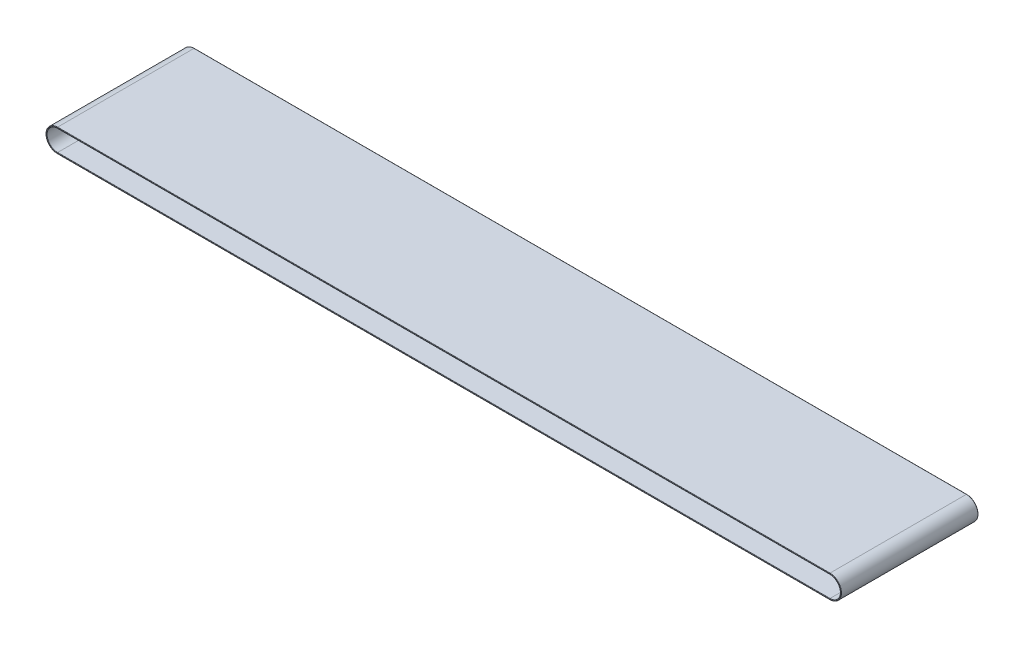
ISO-10303-21;
HEADER;
FILE_DESCRIPTION(('STEP AP214'),'2;1');
FILE_NAME('part.step','',(''),(''),'','','');
FILE_SCHEMA(('AUTOMOTIVE_DESIGN { 1 0 10303 214 1 1 1 1 }'));
ENDSEC;
DATA;
#1=APPLICATION_CONTEXT('core data for automotive mechanical design processes');
#2=APPLICATION_PROTOCOL_DEFINITION('international standard','automotive_design',2000,#1);
#3=PRODUCT_CONTEXT('',#1,'mechanical');
#4=PRODUCT('Part','Part','',(#3));
#5=PRODUCT_RELATED_PRODUCT_CATEGORY('part','',(#4));
#6=PRODUCT_DEFINITION_FORMATION('','',#4);
#7=PRODUCT_DEFINITION_CONTEXT('part definition',#1,'design');
#8=PRODUCT_DEFINITION('design','',#6,#7);
#9=PRODUCT_DEFINITION_SHAPE('','',#8);
#10=(LENGTH_UNIT() NAMED_UNIT(*) SI_UNIT(.MILLI.,.METRE.));
#11=(NAMED_UNIT(*) PLANE_ANGLE_UNIT() SI_UNIT($,.RADIAN.));
#12=(NAMED_UNIT(*) SI_UNIT($,.STERADIAN.) SOLID_ANGLE_UNIT());
#13=UNCERTAINTY_MEASURE_WITH_UNIT(LENGTH_MEASURE(1.E-05),#10,'distance_accuracy_value','');
#14=(GEOMETRIC_REPRESENTATION_CONTEXT(3) GLOBAL_UNCERTAINTY_ASSIGNED_CONTEXT((#13)) GLOBAL_UNIT_ASSIGNED_CONTEXT((#10,
#11,#12)) REPRESENTATION_CONTEXT('',''));
#15=CARTESIAN_POINT('',(0.,0.,0.));
#16=DIRECTION('',(0.,0.,1.));
#17=DIRECTION('',(1.,0.,0.));
#18=AXIS2_PLACEMENT_3D('',#15,#16,#17);
#19=CARTESIAN_POINT('',(0.,4.25449999999998,50.673));
#20=DIRECTION('',(0.,1.,0.));
#21=DIRECTION('',(0.,0.,1.));
#22=AXIS2_PLACEMENT_3D('',#19,#20,#21);
#23=PLANE('',#22);
#24=DIRECTION('',(0.,0.,-1.));
#25=VECTOR('',#24,1.);
#26=CARTESIAN_POINT('',(142.875,4.25449999999998,50.673));
#27=LINE('',#26,#25);
#28=CARTESIAN_POINT('',(142.875,4.25449999999998,50.546));
#29=VERTEX_POINT('',#28);
#30=CARTESIAN_POINT('',(142.875,4.25449999999998,0.127000000000002));
#31=VERTEX_POINT('',#30);
#32=EDGE_CURVE('E293',#29,#31,#27,.T.);
#33=ORIENTED_EDGE('',*,*,#32,.T.);
#34=DIRECTION('',(1.,0.,0.));
#35=VECTOR('',#34,1.);
#36=CARTESIAN_POINT('',(-142.875,4.25449999999998,0.127));
#37=LINE('',#36,#35);
#38=CARTESIAN_POINT('',(-142.875,4.25449999999998,0.127000000000002));
#39=VERTEX_POINT('',#38);
#40=EDGE_CURVE('E11',#31,#39,#37,.F.);
#41=ORIENTED_EDGE('',*,*,#40,.T.);
#42=DIRECTION('',(0.,0.,-1.));
#43=VECTOR('',#42,1.);
#44=CARTESIAN_POINT('',(-142.875,4.25449999999998,50.673));
#45=LINE('',#44,#43);
#46=CARTESIAN_POINT('',(-142.875,4.25449999999998,50.546));
#47=VERTEX_POINT('',#46);
#48=EDGE_CURVE('E177',#47,#39,#45,.T.);
#49=ORIENTED_EDGE('',*,*,#48,.F.);
#50=DIRECTION('',(1.,0.,0.));
#51=VECTOR('',#50,1.);
#52=CARTESIAN_POINT('',(0.,4.25449999999998,50.546));
#53=LINE('',#52,#51);
#54=EDGE_CURVE('E50',#47,#29,#53,.T.);
#55=ORIENTED_EDGE('',*,*,#54,.T.);
#56=EDGE_LOOP('',(#33,#41,#49,#55));
#57=FACE_BOUND('',#56,.T.);
#58=ADVANCED_FACE('F41',(#57),#23,.T.);
#59=CARTESIAN_POINT('',(-142.875,0.,50.673));
#60=DIRECTION('',(0.,0.,-1.));
#61=DIRECTION('',(-1.,0.,0.));
#62=AXIS2_PLACEMENT_3D('',#59,#60,#61);
#63=CYLINDRICAL_SURFACE('',#62,4.25449999999999);
#64=ORIENTED_EDGE('',*,*,#48,.T.);
#65=CARTESIAN_POINT('',(-142.875,0.,0.127000000000002));
#66=DIRECTION('',(0.,0.,1.));
#67=DIRECTION('',(1.,0.,0.));
#68=AXIS2_PLACEMENT_3D('',#65,#66,#67);
#69=CIRCLE('',#68,4.25449999999999);
#70=CARTESIAN_POINT('',(-142.875,-4.25450000000001,0.127000000000002));
#71=VERTEX_POINT('',#70);
#72=EDGE_CURVE('E163',#39,#71,#69,.T.);
#73=ORIENTED_EDGE('',*,*,#72,.T.);
#74=DIRECTION('',(0.,0.,-1.));
#75=VECTOR('',#74,1.);
#76=CARTESIAN_POINT('',(-142.875,-4.25450000000001,50.673));
#77=LINE('',#76,#75);
#78=CARTESIAN_POINT('',(-142.875,-4.25450000000001,50.546));
#79=VERTEX_POINT('',#78);
#80=EDGE_CURVE('E299',#79,#71,#77,.T.);
#81=ORIENTED_EDGE('',*,*,#80,.F.);
#82=CARTESIAN_POINT('',(-142.875,0.,50.546));
#83=DIRECTION('',(0.,0.,1.));
#84=DIRECTION('',(1.,0.,0.));
#85=AXIS2_PLACEMENT_3D('',#82,#83,#84);
#86=CIRCLE('',#85,4.25449999999999);
#87=EDGE_CURVE('E209',#79,#47,#86,.F.);
#88=ORIENTED_EDGE('',*,*,#87,.T.);
#89=EDGE_LOOP('',(#64,#73,#81,#88));
#90=FACE_BOUND('',#89,.T.);
#91=ADVANCED_FACE('F322',(#90),#63,.T.);
#92=CARTESIAN_POINT('',(0.,-4.25450000000001,50.673));
#93=DIRECTION('',(0.,1.,0.));
#94=DIRECTION('',(-1.,0.,0.));
#95=AXIS2_PLACEMENT_3D('',#92,#93,#94);
#96=PLANE('',#95);
#97=ORIENTED_EDGE('',*,*,#80,.T.);
#98=DIRECTION('',(1.,0.,0.));
#99=VECTOR('',#98,1.);
#100=CARTESIAN_POINT('',(0.,-4.25450000000001,0.127000000000002));
#101=LINE('',#100,#99);
#102=CARTESIAN_POINT('',(142.875,-4.25450000000001,0.127000000000002));
#103=VERTEX_POINT('',#102);
#104=EDGE_CURVE('E215',#71,#103,#101,.T.);
#105=ORIENTED_EDGE('',*,*,#104,.T.);
#106=DIRECTION('',(0.,0.,-1.));
#107=VECTOR('',#106,1.);
#108=CARTESIAN_POINT('',(142.875,-4.25450000000001,50.673));
#109=LINE('',#108,#107);
#110=CARTESIAN_POINT('',(142.875,-4.25450000000001,50.546));
#111=VERTEX_POINT('',#110);
#112=EDGE_CURVE('E290',#111,#103,#109,.T.);
#113=ORIENTED_EDGE('',*,*,#112,.F.);
#114=DIRECTION('',(1.,0.,0.));
#115=VECTOR('',#114,1.);
#116=CARTESIAN_POINT('',(-142.875,-4.25450000000001,50.546));
#117=LINE('',#116,#115);
#118=EDGE_CURVE('E213',#111,#79,#117,.F.);
#119=ORIENTED_EDGE('',*,*,#118,.T.);
#120=EDGE_LOOP('',(#97,#105,#113,#119));
#121=FACE_BOUND('',#120,.T.);
#122=ADVANCED_FACE('F296',(#121),#96,.F.);
#123=CARTESIAN_POINT('',(142.875,0.,50.673));
#124=DIRECTION('',(0.,0.,-1.));
#125=DIRECTION('',(-1.,0.,0.));
#126=AXIS2_PLACEMENT_3D('',#123,#124,#125);
#127=CYLINDRICAL_SURFACE('',#126,3.87349999999999);
#128=DIRECTION('',(0.,0.,-1.));
#129=VECTOR('',#128,1.);
#130=CARTESIAN_POINT('',(142.875,3.87349999999998,50.673));
#131=LINE('',#130,#129);
#132=CARTESIAN_POINT('',(142.875,3.87349999999998,50.546));
#133=VERTEX_POINT('',#132);
#134=CARTESIAN_POINT('',(142.875,3.87349999999998,0.127000000000002));
#135=VERTEX_POINT('',#134);
#136=EDGE_CURVE('E251',#133,#135,#131,.T.);
#137=ORIENTED_EDGE('',*,*,#136,.T.);
#138=CARTESIAN_POINT('',(142.875,0.,0.127000000000002));
#139=DIRECTION('',(0.,0.,1.));
#140=DIRECTION('',(1.,0.,0.));
#141=AXIS2_PLACEMENT_3D('',#138,#139,#140);
#142=CIRCLE('',#141,3.87349999999999);
#143=CARTESIAN_POINT('',(142.875,-3.87350000000001,0.127000000000002));
#144=VERTEX_POINT('',#143);
#145=EDGE_CURVE('E207',#135,#144,#142,.F.);
#146=ORIENTED_EDGE('',*,*,#145,.T.);
#147=DIRECTION('',(0.,0.,-1.));
#148=VECTOR('',#147,1.);
#149=CARTESIAN_POINT('',(142.875,-3.87350000000001,50.673));
#150=LINE('',#149,#148);
#151=CARTESIAN_POINT('',(142.875,-3.87350000000001,50.546));
#152=VERTEX_POINT('',#151);
#153=EDGE_CURVE('E302',#152,#144,#150,.T.);
#154=ORIENTED_EDGE('',*,*,#153,.F.);
#155=CARTESIAN_POINT('',(142.875,0.,50.546));
#156=DIRECTION('',(0.,0.,1.));
#157=DIRECTION('',(1.,0.,0.));
#158=AXIS2_PLACEMENT_3D('',#155,#156,#157);
#159=CIRCLE('',#158,3.87349999999999);
#160=EDGE_CURVE('E205',#152,#133,#159,.T.);
#161=ORIENTED_EDGE('',*,*,#160,.T.);
#162=EDGE_LOOP('',(#137,#146,#154,#161));
#163=FACE_BOUND('',#162,.T.);
#164=ADVANCED_FACE('F345',(#163),#127,.F.);
#165=CARTESIAN_POINT('',(0.,-3.87350000000001,50.673));
#166=DIRECTION('',(0.,1.,0.));
#167=DIRECTION('',(-1.,0.,0.));
#168=AXIS2_PLACEMENT_3D('',#165,#166,#167);
#169=PLANE('',#168);
#170=ORIENTED_EDGE('',*,*,#153,.T.);
#171=DIRECTION('',(1.,0.,0.));
#172=VECTOR('',#171,1.);
#173=CARTESIAN_POINT('',(-142.875,-3.87350000000001,0.127));
#174=LINE('',#173,#172);
#175=CARTESIAN_POINT('',(-142.875,-3.87350000000001,0.127000000000002));
#176=VERTEX_POINT('',#175);
#177=EDGE_CURVE('E203',#144,#176,#174,.F.);
#178=ORIENTED_EDGE('',*,*,#177,.T.);
#179=DIRECTION('',(0.,0.,-1.));
#180=VECTOR('',#179,1.);
#181=CARTESIAN_POINT('',(-142.875,-3.87350000000001,50.673));
#182=LINE('',#181,#180);
#183=CARTESIAN_POINT('',(-142.875,-3.87350000000001,50.546));
#184=VERTEX_POINT('',#183);
#185=EDGE_CURVE('E312',#184,#176,#182,.T.);
#186=ORIENTED_EDGE('',*,*,#185,.F.);
#187=DIRECTION('',(1.,0.,0.));
#188=VECTOR('',#187,1.);
#189=CARTESIAN_POINT('',(0.,-3.87350000000001,50.546));
#190=LINE('',#189,#188);
#191=EDGE_CURVE('E201',#184,#152,#190,.T.);
#192=ORIENTED_EDGE('',*,*,#191,.T.);
#193=EDGE_LOOP('',(#170,#178,#186,#192));
#194=FACE_BOUND('',#193,.T.);
#195=ADVANCED_FACE('F341',(#194),#169,.T.);
#196=CARTESIAN_POINT('',(-142.875,0.,50.673));
#197=DIRECTION('',(0.,0.,-1.));
#198=DIRECTION('',(-1.,0.,0.));
#199=AXIS2_PLACEMENT_3D('',#196,#197,#198);
#200=CYLINDRICAL_SURFACE('',#199,3.87349999999999);
#201=ORIENTED_EDGE('',*,*,#185,.T.);
#202=CARTESIAN_POINT('',(-142.875,0.,0.127000000000002));
#203=DIRECTION('',(0.,0.,1.));
#204=DIRECTION('',(1.,0.,0.));
#205=AXIS2_PLACEMENT_3D('',#202,#203,#204);
#206=CIRCLE('',#205,3.87349999999999);
#207=CARTESIAN_POINT('',(-142.875,3.87349999999998,0.127000000000002));
#208=VERTEX_POINT('',#207);
#209=EDGE_CURVE('E198',#176,#208,#206,.F.);
#210=ORIENTED_EDGE('',*,*,#209,.T.);
#211=DIRECTION('',(0.,0.,-1.));
#212=VECTOR('',#211,1.);
#213=CARTESIAN_POINT('',(-142.875,3.87349999999998,50.673));
#214=LINE('',#213,#212);
#215=CARTESIAN_POINT('',(-142.875,3.87349999999998,50.546));
#216=VERTEX_POINT('',#215);
#217=EDGE_CURVE('E309',#216,#208,#214,.T.);
#218=ORIENTED_EDGE('',*,*,#217,.F.);
#219=CARTESIAN_POINT('',(-142.875,0.,50.546));
#220=DIRECTION('',(0.,0.,1.));
#221=DIRECTION('',(1.,0.,0.));
#222=AXIS2_PLACEMENT_3D('',#219,#220,#221);
#223=CIRCLE('',#222,3.87349999999999);
#224=EDGE_CURVE('E195',#216,#184,#223,.T.);
#225=ORIENTED_EDGE('',*,*,#224,.T.);
#226=EDGE_LOOP('',(#201,#210,#218,#225));
#227=FACE_BOUND('',#226,.T.);
#228=ADVANCED_FACE('F337',(#227),#200,.F.);
#229=CARTESIAN_POINT('',(0.,3.87349999999998,50.673));
#230=DIRECTION('',(0.,1.,0.));
#231=DIRECTION('',(-1.,0.,0.));
#232=AXIS2_PLACEMENT_3D('',#229,#230,#231);
#233=PLANE('',#232);
#234=ORIENTED_EDGE('',*,*,#217,.T.);
#235=DIRECTION('',(1.,0.,0.));
#236=VECTOR('',#235,1.);
#237=CARTESIAN_POINT('',(0.,3.87349999999998,0.127000000000002));
#238=LINE('',#237,#236);
#239=EDGE_CURVE('E238',#208,#135,#238,.T.);
#240=ORIENTED_EDGE('',*,*,#239,.T.);
#241=ORIENTED_EDGE('',*,*,#136,.F.);
#242=DIRECTION('',(1.,0.,0.));
#243=VECTOR('',#242,1.);
#244=CARTESIAN_POINT('',(-142.875,3.87349999999998,50.546));
#245=LINE('',#244,#243);
#246=EDGE_CURVE('E236',#133,#216,#245,.F.);
#247=ORIENTED_EDGE('',*,*,#246,.T.);
#248=EDGE_LOOP('',(#234,#240,#241,#247));
#249=FACE_BOUND('',#248,.T.);
#250=ADVANCED_FACE('F334',(#249),#233,.F.);
#251=CARTESIAN_POINT('',(142.875,0.,50.673));
#252=DIRECTION('',(0.,0.,-1.));
#253=DIRECTION('',(-1.,0.,0.));
#254=AXIS2_PLACEMENT_3D('',#251,#252,#253);
#255=CYLINDRICAL_SURFACE('',#254,4.25449999999999);
#256=ORIENTED_EDGE('',*,*,#112,.T.);
#257=CARTESIAN_POINT('',(142.875,0.,0.127000000000002));
#258=DIRECTION('',(0.,0.,1.));
#259=DIRECTION('',(1.,0.,0.));
#260=AXIS2_PLACEMENT_3D('',#257,#258,#259);
#261=CIRCLE('',#260,4.25449999999999);
#262=EDGE_CURVE('E219',#103,#31,#261,.T.);
#263=ORIENTED_EDGE('',*,*,#262,.T.);
#264=ORIENTED_EDGE('',*,*,#32,.F.);
#265=CARTESIAN_POINT('',(142.875,0.,50.546));
#266=DIRECTION('',(0.,0.,1.));
#267=DIRECTION('',(1.,0.,0.));
#268=AXIS2_PLACEMENT_3D('',#265,#266,#267);
#269=CIRCLE('',#268,4.25449999999999);
#270=EDGE_CURVE('E217',#29,#111,#269,.F.);
#271=ORIENTED_EDGE('',*,*,#270,.T.);
#272=EDGE_LOOP('',(#256,#263,#264,#271));
#273=FACE_BOUND('',#272,.T.);
#274=ADVANCED_FACE('F289',(#273),#255,.T.);
#275=CARTESIAN_POINT('',(0.,0.,50.673));
#276=DIRECTION('',(0.,0.,1.));
#277=DIRECTION('',(1.,0.,0.));
#278=AXIS2_PLACEMENT_3D('',#275,#276,#277);
#279=PLANE('',#278);
#280=DIRECTION('',(1.,0.,0.));
#281=VECTOR('',#280,1.);
#282=CARTESIAN_POINT('',(0.,-4.00050000000001,50.673));
#283=LINE('',#282,#281);
#284=CARTESIAN_POINT('',(142.875,-4.00050000000001,50.673));
#285=VERTEX_POINT('',#284);
#286=CARTESIAN_POINT('',(-142.875,-4.00050000000001,50.673));
#287=VERTEX_POINT('',#286);
#288=EDGE_CURVE('E58',#285,#287,#283,.F.);
#289=ORIENTED_EDGE('',*,*,#288,.T.);
#290=CARTESIAN_POINT('',(-142.875,0.,50.673));
#291=DIRECTION('',(0.,0.,1.));
#292=DIRECTION('',(1.,0.,0.));
#293=AXIS2_PLACEMENT_3D('',#290,#291,#292);
#294=CIRCLE('',#293,4.00049999999999);
#295=CARTESIAN_POINT('',(-142.875,4.00049999999998,50.673));
#296=VERTEX_POINT('',#295);
#297=EDGE_CURVE('E234',#287,#296,#294,.F.);
#298=ORIENTED_EDGE('',*,*,#297,.T.);
#299=DIRECTION('',(1.,0.,0.));
#300=VECTOR('',#299,1.);
#301=CARTESIAN_POINT('',(142.875,4.00049999999998,50.673));
#302=LINE('',#301,#300);
#303=CARTESIAN_POINT('',(142.875,4.00049999999998,50.673));
#304=VERTEX_POINT('',#303);
#305=EDGE_CURVE('E230',#296,#304,#302,.T.);
#306=ORIENTED_EDGE('',*,*,#305,.T.);
#307=CARTESIAN_POINT('',(142.875,0.,50.673));
#308=DIRECTION('',(0.,0.,1.));
#309=DIRECTION('',(1.,0.,0.));
#310=AXIS2_PLACEMENT_3D('',#307,#308,#309);
#311=CIRCLE('',#310,4.00049999999999);
#312=EDGE_CURVE('E63',#304,#285,#311,.F.);
#313=ORIENTED_EDGE('',*,*,#312,.T.);
#314=EDGE_LOOP('',(#289,#298,#306,#313));
#315=FACE_BOUND('',#314,.T.);
#316=DIRECTION('',(1.,0.,0.));
#317=VECTOR('',#316,1.);
#318=CARTESIAN_POINT('',(0.,4.12749999999998,50.673));
#319=LINE('',#318,#317);
#320=CARTESIAN_POINT('',(142.875,4.12749999999998,50.673));
#321=VERTEX_POINT('',#320);
#322=CARTESIAN_POINT('',(-142.875,4.12749999999998,50.673));
#323=VERTEX_POINT('',#322);
#324=EDGE_CURVE('E221',#321,#323,#319,.F.);
#325=ORIENTED_EDGE('',*,*,#324,.T.);
#326=CARTESIAN_POINT('',(-142.875,0.,50.673));
#327=DIRECTION('',(0.,0.,1.));
#328=DIRECTION('',(1.,0.,0.));
#329=AXIS2_PLACEMENT_3D('',#326,#327,#328);
#330=CIRCLE('',#329,4.12749999999999);
#331=CARTESIAN_POINT('',(-142.875,-4.12750000000001,50.673));
#332=VERTEX_POINT('',#331);
#333=EDGE_CURVE('E227',#323,#332,#330,.T.);
#334=ORIENTED_EDGE('',*,*,#333,.T.);
#335=DIRECTION('',(1.,0.,0.));
#336=VECTOR('',#335,1.);
#337=CARTESIAN_POINT('',(142.875,-4.12750000000001,50.673));
#338=LINE('',#337,#336);
#339=CARTESIAN_POINT('',(142.875,-4.12750000000001,50.673));
#340=VERTEX_POINT('',#339);
#341=EDGE_CURVE('E225',#332,#340,#338,.T.);
#342=ORIENTED_EDGE('',*,*,#341,.T.);
#343=CARTESIAN_POINT('',(142.875,0.,50.673));
#344=DIRECTION('',(0.,0.,1.));
#345=DIRECTION('',(1.,0.,0.));
#346=AXIS2_PLACEMENT_3D('',#343,#344,#345);
#347=CIRCLE('',#346,4.12749999999999);
#348=EDGE_CURVE('E223',#340,#321,#347,.T.);
#349=ORIENTED_EDGE('',*,*,#348,.T.);
#350=EDGE_LOOP('',(#325,#334,#342,#349));
#351=FACE_BOUND('',#350,.T.);
#352=ADVANCED_FACE('F456',(#315,#351),#279,.T.);
#353=CARTESIAN_POINT('',(0.,0.,0.));
#354=DIRECTION('',(0.,0.,1.));
#355=DIRECTION('',(1.,0.,0.));
#356=AXIS2_PLACEMENT_3D('',#353,#354,#355);
#357=PLANE('',#356);
#358=DIRECTION('',(1.,0.,0.));
#359=VECTOR('',#358,1.);
#360=CARTESIAN_POINT('',(0.,4.00049999999998,0.));
#361=LINE('',#360,#359);
#362=CARTESIAN_POINT('',(142.875,4.00049999999998,0.));
#363=VERTEX_POINT('',#362);
#364=CARTESIAN_POINT('',(-142.875,4.00049999999998,0.));
#365=VERTEX_POINT('',#364);
#366=EDGE_CURVE('E182',#363,#365,#361,.F.);
#367=ORIENTED_EDGE('',*,*,#366,.T.);
#368=CARTESIAN_POINT('',(-142.875,0.,0.));
#369=DIRECTION('',(0.,0.,1.));
#370=DIRECTION('',(1.,0.,0.));
#371=AXIS2_PLACEMENT_3D('',#368,#369,#370);
#372=CIRCLE('',#371,4.00049999999999);
#373=CARTESIAN_POINT('',(-142.875,-4.00050000000001,0.));
#374=VERTEX_POINT('',#373);
#375=EDGE_CURVE('E192',#365,#374,#372,.T.);
#376=ORIENTED_EDGE('',*,*,#375,.T.);
#377=DIRECTION('',(1.,0.,0.));
#378=VECTOR('',#377,1.);
#379=CARTESIAN_POINT('',(142.875,-4.00050000000001,0.));
#380=LINE('',#379,#378);
#381=CARTESIAN_POINT('',(142.875,-4.00050000000001,0.));
#382=VERTEX_POINT('',#381);
#383=EDGE_CURVE('E190',#374,#382,#380,.T.);
#384=ORIENTED_EDGE('',*,*,#383,.T.);
#385=CARTESIAN_POINT('',(142.875,0.,0.));
#386=DIRECTION('',(0.,0.,1.));
#387=DIRECTION('',(1.,0.,0.));
#388=AXIS2_PLACEMENT_3D('',#385,#386,#387);
#389=CIRCLE('',#388,4.00049999999999);
#390=EDGE_CURVE('E184',#382,#363,#389,.T.);
#391=ORIENTED_EDGE('',*,*,#390,.T.);
#392=EDGE_LOOP('',(#367,#376,#384,#391));
#393=FACE_BOUND('',#392,.T.);
#394=DIRECTION('',(1.,0.,0.));
#395=VECTOR('',#394,1.);
#396=CARTESIAN_POINT('',(0.,-4.12750000000001,0.));
#397=LINE('',#396,#395);
#398=CARTESIAN_POINT('',(142.875,-4.12750000000001,0.));
#399=VERTEX_POINT('',#398);
#400=CARTESIAN_POINT('',(-142.875,-4.12750000000001,0.));
#401=VERTEX_POINT('',#400);
#402=EDGE_CURVE('E181',#399,#401,#397,.F.);
#403=ORIENTED_EDGE('',*,*,#402,.T.);
#404=CARTESIAN_POINT('',(-142.875,0.,0.));
#405=DIRECTION('',(0.,0.,1.));
#406=DIRECTION('',(1.,0.,0.));
#407=AXIS2_PLACEMENT_3D('',#404,#405,#406);
#408=CIRCLE('',#407,4.12749999999999);
#409=CARTESIAN_POINT('',(-142.875,4.12749999999998,0.));
#410=VERTEX_POINT('',#409);
#411=EDGE_CURVE('E160',#401,#410,#408,.F.);
#412=ORIENTED_EDGE('',*,*,#411,.T.);
#413=DIRECTION('',(1.,0.,0.));
#414=VECTOR('',#413,1.);
#415=CARTESIAN_POINT('',(142.875,4.12749999999998,0.));
#416=LINE('',#415,#414);
#417=CARTESIAN_POINT('',(142.875,4.12749999999998,0.));
#418=VERTEX_POINT('',#417);
#419=EDGE_CURVE('E170',#410,#418,#416,.T.);
#420=ORIENTED_EDGE('',*,*,#419,.T.);
#421=CARTESIAN_POINT('',(142.875,0.,0.));
#422=DIRECTION('',(0.,0.,1.));
#423=DIRECTION('',(1.,0.,0.));
#424=AXIS2_PLACEMENT_3D('',#421,#422,#423);
#425=CIRCLE('',#424,4.12749999999999);
#426=EDGE_CURVE('E176',#418,#399,#425,.F.);
#427=ORIENTED_EDGE('',*,*,#426,.T.);
#428=EDGE_LOOP('',(#403,#412,#420,#427));
#429=FACE_BOUND('',#428,.T.);
#430=ADVANCED_FACE('F179',(#393,#429),#357,.F.);
#431=CARTESIAN_POINT('',(142.875,0.,0.127000000000002));
#432=DIRECTION('',(0.,0.,1.));
#433=DIRECTION('',(1.,0.,0.));
#434=AXIS2_PLACEMENT_3D('',#431,#432,#433);
#435=TOROIDAL_SURFACE('',#434,4.00049999999999,0.127);
#436=CARTESIAN_POINT('',(142.875,-4.00050000000001,0.127000000000002));
#437=DIRECTION('',(-1.,0.,0.));
#438=DIRECTION('',(0.,0.,1.));
#439=AXIS2_PLACEMENT_3D('',#436,#437,#438);
#440=CIRCLE('',#439,0.127);
#441=EDGE_CURVE('E245',#144,#382,#440,.T.);
#442=ORIENTED_EDGE('',*,*,#441,.F.);
#443=ORIENTED_EDGE('',*,*,#145,.F.);
#444=CARTESIAN_POINT('',(142.875,4.00049999999998,0.127));
#445=DIRECTION('',(-1.,0.,0.));
#446=DIRECTION('',(0.,0.,1.));
#447=AXIS2_PLACEMENT_3D('',#444,#445,#446);
#448=CIRCLE('',#447,0.127);
#449=EDGE_CURVE('E248',#363,#135,#448,.T.);
#450=ORIENTED_EDGE('',*,*,#449,.F.);
#451=ORIENTED_EDGE('',*,*,#390,.F.);
#452=EDGE_LOOP('',(#442,#443,#450,#451));
#453=FACE_BOUND('',#452,.T.);
#454=ADVANCED_FACE('F361',(#453),#435,.T.);
#455=CARTESIAN_POINT('',(0.,4.00049999999998,0.127000000000002));
#456=DIRECTION('',(1.,0.,0.));
#457=DIRECTION('',(0.,1.,0.));
#458=AXIS2_PLACEMENT_3D('',#455,#456,#457);
#459=CYLINDRICAL_SURFACE('',#458,0.127);
#460=ORIENTED_EDGE('',*,*,#449,.T.);
#461=ORIENTED_EDGE('',*,*,#239,.F.);
#462=CARTESIAN_POINT('',(-142.875,4.00049999999998,0.127));
#463=DIRECTION('',(-1.,0.,0.));
#464=DIRECTION('',(0.,0.,1.));
#465=AXIS2_PLACEMENT_3D('',#462,#463,#464);
#466=CIRCLE('',#465,0.127);
#467=EDGE_CURVE('E243',#365,#208,#466,.T.);
#468=ORIENTED_EDGE('',*,*,#467,.F.);
#469=ORIENTED_EDGE('',*,*,#366,.F.);
#470=EDGE_LOOP('',(#460,#461,#468,#469));
#471=FACE_BOUND('',#470,.T.);
#472=ADVANCED_FACE('F357',(#471),#459,.T.);
#473=CARTESIAN_POINT('',(0.,-4.00050000000001,0.127));
#474=DIRECTION('',(-1.,0.,0.));
#475=DIRECTION('',(0.,-1.,0.));
#476=AXIS2_PLACEMENT_3D('',#473,#474,#475);
#477=CYLINDRICAL_SURFACE('',#476,0.127);
#478=ORIENTED_EDGE('',*,*,#441,.T.);
#479=ORIENTED_EDGE('',*,*,#383,.F.);
#480=CARTESIAN_POINT('',(-142.875,-4.00050000000001,0.127));
#481=DIRECTION('',(-1.,0.,0.));
#482=DIRECTION('',(0.,0.,1.));
#483=AXIS2_PLACEMENT_3D('',#480,#481,#482);
#484=CIRCLE('',#483,0.127);
#485=EDGE_CURVE('E241',#176,#374,#484,.T.);
#486=ORIENTED_EDGE('',*,*,#485,.F.);
#487=ORIENTED_EDGE('',*,*,#177,.F.);
#488=EDGE_LOOP('',(#478,#479,#486,#487));
#489=FACE_BOUND('',#488,.T.);
#490=ADVANCED_FACE('F353',(#489),#477,.T.);
#491=CARTESIAN_POINT('',(-142.875,0.,0.127000000000002));
#492=DIRECTION('',(0.,0.,1.));
#493=DIRECTION('',(1.,0.,0.));
#494=AXIS2_PLACEMENT_3D('',#491,#492,#493);
#495=TOROIDAL_SURFACE('',#494,4.00049999999999,0.127);
#496=ORIENTED_EDGE('',*,*,#467,.T.);
#497=ORIENTED_EDGE('',*,*,#209,.F.);
#498=ORIENTED_EDGE('',*,*,#485,.T.);
#499=ORIENTED_EDGE('',*,*,#375,.F.);
#500=EDGE_LOOP('',(#496,#497,#498,#499));
#501=FACE_BOUND('',#500,.T.);
#502=ADVANCED_FACE('F350',(#501),#495,.T.);
#503=CARTESIAN_POINT('',(142.875,0.,0.127000000000002));
#504=DIRECTION('',(0.,0.,1.));
#505=DIRECTION('',(1.,0.,0.));
#506=AXIS2_PLACEMENT_3D('',#503,#504,#505);
#507=TOROIDAL_SURFACE('',#506,4.12749999999999,0.127);
#508=CARTESIAN_POINT('',(142.875,-4.12750000000001,0.127));
#509=DIRECTION('',(-1.,0.,0.));
#510=DIRECTION('',(0.,0.,1.));
#511=AXIS2_PLACEMENT_3D('',#508,#509,#510);
#512=CIRCLE('',#511,0.127);
#513=EDGE_CURVE('E166',#399,#103,#512,.T.);
#514=ORIENTED_EDGE('',*,*,#513,.F.);
#515=ORIENTED_EDGE('',*,*,#426,.F.);
#516=CARTESIAN_POINT('',(142.875,4.12749999999998,0.127000000000002));
#517=DIRECTION('',(-1.,0.,0.));
#518=DIRECTION('',(0.,0.,1.));
#519=AXIS2_PLACEMENT_3D('',#516,#517,#518);
#520=CIRCLE('',#519,0.127);
#521=EDGE_CURVE('E173',#31,#418,#520,.T.);
#522=ORIENTED_EDGE('',*,*,#521,.F.);
#523=ORIENTED_EDGE('',*,*,#262,.F.);
#524=EDGE_LOOP('',(#514,#515,#522,#523));
#525=FACE_BOUND('',#524,.T.);
#526=ADVANCED_FACE('F318',(#525),#507,.T.);
#527=CARTESIAN_POINT('',(0.,4.12749999999998,0.127));
#528=DIRECTION('',(-1.,0.,0.));
#529=DIRECTION('',(0.,0.,1.));
#530=AXIS2_PLACEMENT_3D('',#527,#528,#529);
#531=CYLINDRICAL_SURFACE('',#530,0.127);
#532=ORIENTED_EDGE('',*,*,#521,.T.);
#533=ORIENTED_EDGE('',*,*,#419,.F.);
#534=CARTESIAN_POINT('',(-142.875,4.12749999999998,0.127));
#535=DIRECTION('',(-1.,0.,0.));
#536=DIRECTION('',(0.,0.,1.));
#537=AXIS2_PLACEMENT_3D('',#534,#535,#536);
#538=CIRCLE('',#537,0.127);
#539=EDGE_CURVE('E156',#39,#410,#538,.T.);
#540=ORIENTED_EDGE('',*,*,#539,.F.);
#541=ORIENTED_EDGE('',*,*,#40,.F.);
#542=EDGE_LOOP('',(#532,#533,#540,#541));
#543=FACE_BOUND('',#542,.T.);
#544=ADVANCED_FACE('F171',(#543),#531,.T.);
#545=CARTESIAN_POINT('',(0.,-4.12750000000001,0.127000000000002));
#546=DIRECTION('',(1.,0.,0.));
#547=DIRECTION('',(0.,1.,0.));
#548=AXIS2_PLACEMENT_3D('',#545,#546,#547);
#549=CYLINDRICAL_SURFACE('',#548,0.127);
#550=ORIENTED_EDGE('',*,*,#513,.T.);
#551=ORIENTED_EDGE('',*,*,#104,.F.);
#552=CARTESIAN_POINT('',(-142.875,-4.12750000000001,0.127));
#553=DIRECTION('',(-1.,0.,0.));
#554=DIRECTION('',(0.,0.,1.));
#555=AXIS2_PLACEMENT_3D('',#552,#553,#554);
#556=CIRCLE('',#555,0.127);
#557=EDGE_CURVE('E167',#401,#71,#556,.T.);
#558=ORIENTED_EDGE('',*,*,#557,.F.);
#559=ORIENTED_EDGE('',*,*,#402,.F.);
#560=EDGE_LOOP('',(#550,#551,#558,#559));
#561=FACE_BOUND('',#560,.T.);
#562=ADVANCED_FACE('F320',(#561),#549,.T.);
#563=CARTESIAN_POINT('',(-142.875,0.,0.127000000000002));
#564=DIRECTION('',(0.,0.,1.));
#565=DIRECTION('',(1.,0.,0.));
#566=AXIS2_PLACEMENT_3D('',#563,#564,#565);
#567=TOROIDAL_SURFACE('',#566,4.12749999999999,0.127);
#568=ORIENTED_EDGE('',*,*,#539,.T.);
#569=ORIENTED_EDGE('',*,*,#411,.F.);
#570=ORIENTED_EDGE('',*,*,#557,.T.);
#571=ORIENTED_EDGE('',*,*,#72,.F.);
#572=EDGE_LOOP('',(#568,#569,#570,#571));
#573=FACE_BOUND('',#572,.T.);
#574=ADVANCED_FACE('F158',(#573),#567,.T.);
#575=CARTESIAN_POINT('',(142.875,0.,50.546));
#576=DIRECTION('',(0.,0.,1.));
#577=DIRECTION('',(1.,0.,0.));
#578=AXIS2_PLACEMENT_3D('',#575,#576,#577);
#579=TOROIDAL_SURFACE('',#578,4.00049999999999,0.127);
#580=CARTESIAN_POINT('',(142.875,-4.00050000000001,50.546));
#581=DIRECTION('',(-1.,0.,0.));
#582=DIRECTION('',(0.,0.,1.));
#583=AXIS2_PLACEMENT_3D('',#580,#581,#582);
#584=CIRCLE('',#583,0.127);
#585=EDGE_CURVE('E261',#285,#152,#584,.T.);
#586=ORIENTED_EDGE('',*,*,#585,.F.);
#587=ORIENTED_EDGE('',*,*,#312,.F.);
#588=CARTESIAN_POINT('',(142.875,4.00049999999998,50.546));
#589=DIRECTION('',(-1.,0.,0.));
#590=DIRECTION('',(0.,0.,1.));
#591=AXIS2_PLACEMENT_3D('',#588,#589,#590);
#592=CIRCLE('',#591,0.127);
#593=EDGE_CURVE('E252',#133,#304,#592,.T.);
#594=ORIENTED_EDGE('',*,*,#593,.F.);
#595=ORIENTED_EDGE('',*,*,#160,.F.);
#596=EDGE_LOOP('',(#586,#587,#594,#595));
#597=FACE_BOUND('',#596,.T.);
#598=ADVANCED_FACE('F368',(#597),#579,.T.);
#599=CARTESIAN_POINT('',(0.,4.00049999999998,50.546));
#600=DIRECTION('',(-1.,0.,0.));
#601=DIRECTION('',(0.,-1.,0.));
#602=AXIS2_PLACEMENT_3D('',#599,#600,#601);
#603=CYLINDRICAL_SURFACE('',#602,0.127);
#604=ORIENTED_EDGE('',*,*,#593,.T.);
#605=ORIENTED_EDGE('',*,*,#305,.F.);
#606=CARTESIAN_POINT('',(-142.875,4.00049999999998,50.546));
#607=DIRECTION('',(-1.,0.,0.));
#608=DIRECTION('',(0.,0.,1.));
#609=AXIS2_PLACEMENT_3D('',#606,#607,#608);
#610=CIRCLE('',#609,0.127);
#611=EDGE_CURVE('E259',#216,#296,#610,.T.);
#612=ORIENTED_EDGE('',*,*,#611,.F.);
#613=ORIENTED_EDGE('',*,*,#246,.F.);
#614=EDGE_LOOP('',(#604,#605,#612,#613));
#615=FACE_BOUND('',#614,.T.);
#616=ADVANCED_FACE('F382',(#615),#603,.T.);
#617=CARTESIAN_POINT('',(0.,-4.00050000000001,50.546));
#618=DIRECTION('',(1.,0.,0.));
#619=DIRECTION('',(0.,1.,0.));
#620=AXIS2_PLACEMENT_3D('',#617,#618,#619);
#621=CYLINDRICAL_SURFACE('',#620,0.127);
#622=ORIENTED_EDGE('',*,*,#585,.T.);
#623=ORIENTED_EDGE('',*,*,#191,.F.);
#624=CARTESIAN_POINT('',(-142.875,-4.00050000000001,50.546));
#625=DIRECTION('',(-1.,0.,0.));
#626=DIRECTION('',(0.,0.,1.));
#627=AXIS2_PLACEMENT_3D('',#624,#625,#626);
#628=CIRCLE('',#627,0.127);
#629=EDGE_CURVE('E257',#287,#184,#628,.T.);
#630=ORIENTED_EDGE('',*,*,#629,.F.);
#631=ORIENTED_EDGE('',*,*,#288,.F.);
#632=EDGE_LOOP('',(#622,#623,#630,#631));
#633=FACE_BOUND('',#632,.T.);
#634=ADVANCED_FACE('F378',(#633),#621,.T.);
#635=CARTESIAN_POINT('',(-142.875,0.,50.546));
#636=DIRECTION('',(0.,0.,1.));
#637=DIRECTION('',(1.,0.,0.));
#638=AXIS2_PLACEMENT_3D('',#635,#636,#637);
#639=TOROIDAL_SURFACE('',#638,4.00049999999999,0.127);
#640=ORIENTED_EDGE('',*,*,#611,.T.);
#641=ORIENTED_EDGE('',*,*,#297,.F.);
#642=ORIENTED_EDGE('',*,*,#629,.T.);
#643=ORIENTED_EDGE('',*,*,#224,.F.);
#644=EDGE_LOOP('',(#640,#641,#642,#643));
#645=FACE_BOUND('',#644,.T.);
#646=ADVANCED_FACE('F375',(#645),#639,.T.);
#647=CARTESIAN_POINT('',(142.875,0.,50.546));
#648=DIRECTION('',(0.,0.,1.));
#649=DIRECTION('',(1.,0.,0.));
#650=AXIS2_PLACEMENT_3D('',#647,#648,#649);
#651=TOROIDAL_SURFACE('',#650,4.12749999999999,0.127);
#652=CARTESIAN_POINT('',(142.875,-4.12750000000001,50.546));
#653=DIRECTION('',(-1.,0.,0.));
#654=DIRECTION('',(0.,0.,1.));
#655=AXIS2_PLACEMENT_3D('',#652,#653,#654);
#656=CIRCLE('',#655,0.127);
#657=EDGE_CURVE('E269',#111,#340,#656,.T.);
#658=ORIENTED_EDGE('',*,*,#657,.F.);
#659=ORIENTED_EDGE('',*,*,#270,.F.);
#660=CARTESIAN_POINT('',(142.875,4.12749999999998,50.546));
#661=DIRECTION('',(-1.,0.,0.));
#662=DIRECTION('',(0.,0.,1.));
#663=AXIS2_PLACEMENT_3D('',#660,#661,#662);
#664=CIRCLE('',#663,0.127);
#665=EDGE_CURVE('E45',#321,#29,#664,.T.);
#666=ORIENTED_EDGE('',*,*,#665,.F.);
#667=ORIENTED_EDGE('',*,*,#348,.F.);
#668=EDGE_LOOP('',(#658,#659,#666,#667));
#669=FACE_BOUND('',#668,.T.);
#670=ADVANCED_FACE('F43',(#669),#651,.T.);
#671=CARTESIAN_POINT('',(0.,4.12749999999998,50.546));
#672=DIRECTION('',(1.,0.,0.));
#673=DIRECTION('',(0.,0.,-1.));
#674=AXIS2_PLACEMENT_3D('',#671,#672,#673);
#675=CYLINDRICAL_SURFACE('',#674,0.127);
#676=ORIENTED_EDGE('',*,*,#665,.T.);
#677=ORIENTED_EDGE('',*,*,#54,.F.);
#678=CARTESIAN_POINT('',(-142.875,4.12749999999998,50.546));
#679=DIRECTION('',(-1.,0.,0.));
#680=DIRECTION('',(0.,0.,1.));
#681=AXIS2_PLACEMENT_3D('',#678,#679,#680);
#682=CIRCLE('',#681,0.127);
#683=EDGE_CURVE('E268',#323,#47,#682,.T.);
#684=ORIENTED_EDGE('',*,*,#683,.F.);
#685=ORIENTED_EDGE('',*,*,#324,.F.);
#686=EDGE_LOOP('',(#676,#677,#684,#685));
#687=FACE_BOUND('',#686,.T.);
#688=ADVANCED_FACE('F280',(#687),#675,.T.);
#689=CARTESIAN_POINT('',(0.,-4.12750000000001,50.546));
#690=DIRECTION('',(-1.,0.,0.));
#691=DIRECTION('',(0.,-1.,0.));
#692=AXIS2_PLACEMENT_3D('',#689,#690,#691);
#693=CYLINDRICAL_SURFACE('',#692,0.127);
#694=ORIENTED_EDGE('',*,*,#657,.T.);
#695=ORIENTED_EDGE('',*,*,#341,.F.);
#696=CARTESIAN_POINT('',(-142.875,-4.12750000000001,50.546));
#697=DIRECTION('',(-1.,0.,0.));
#698=DIRECTION('',(0.,0.,1.));
#699=AXIS2_PLACEMENT_3D('',#696,#697,#698);
#700=CIRCLE('',#699,0.127);
#701=EDGE_CURVE('E266',#79,#332,#700,.T.);
#702=ORIENTED_EDGE('',*,*,#701,.F.);
#703=ORIENTED_EDGE('',*,*,#118,.F.);
#704=EDGE_LOOP('',(#694,#695,#702,#703));
#705=FACE_BOUND('',#704,.T.);
#706=ADVANCED_FACE('F393',(#705),#693,.T.);
#707=CARTESIAN_POINT('',(-142.875,0.,50.546));
#708=DIRECTION('',(0.,0.,1.));
#709=DIRECTION('',(1.,0.,0.));
#710=AXIS2_PLACEMENT_3D('',#707,#708,#709);
#711=TOROIDAL_SURFACE('',#710,4.12749999999999,0.127);
#712=ORIENTED_EDGE('',*,*,#683,.T.);
#713=ORIENTED_EDGE('',*,*,#87,.F.);
#714=ORIENTED_EDGE('',*,*,#701,.T.);
#715=ORIENTED_EDGE('',*,*,#333,.F.);
#716=EDGE_LOOP('',(#712,#713,#714,#715));
#717=FACE_BOUND('',#716,.T.);
#718=ADVANCED_FACE('F390',(#717),#711,.T.);
#719=CLOSED_SHELL('',(#58,#91,#122,#164,#195,#228,#250,#274,#352,#430,#454,#472,#490,#502,#526,
#544,#562,#574,#598,#616,#634,#646,#670,#688,#706,#718));
#720=MANIFOLD_SOLID_BREP('B2',#719);
#721=ADVANCED_BREP_SHAPE_REPRESENTATION('',(#18,#720),#14);
#722=SHAPE_DEFINITION_REPRESENTATION(#9,#721);
ENDSEC;
END-ISO-10303-21;
